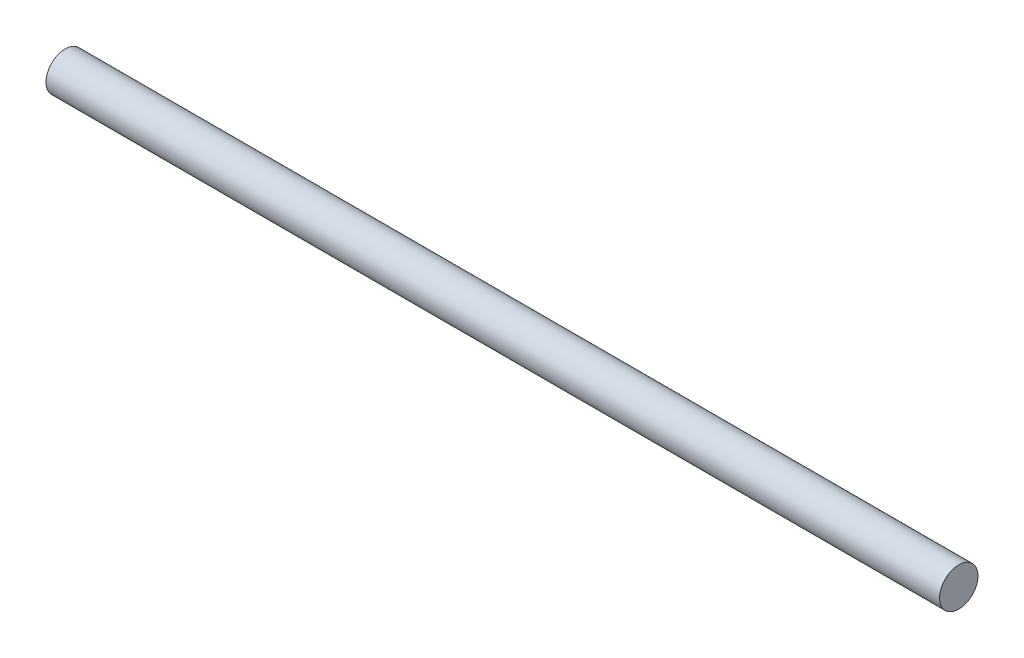
ISO-10303-21;
HEADER;
FILE_DESCRIPTION(('STEP AP214'),'2;1');
FILE_NAME('part.step','',(''),(''),'','','');
FILE_SCHEMA(('AUTOMOTIVE_DESIGN { 1 0 10303 214 1 1 1 1 }'));
ENDSEC;
DATA;
#1=APPLICATION_CONTEXT('core data for automotive mechanical design processes');
#2=APPLICATION_PROTOCOL_DEFINITION('international standard','automotive_design',2000,#1);
#3=PRODUCT_CONTEXT('',#1,'mechanical');
#4=PRODUCT('Part','Part','',(#3));
#5=PRODUCT_RELATED_PRODUCT_CATEGORY('part','',(#4));
#6=PRODUCT_DEFINITION_FORMATION('','',#4);
#7=PRODUCT_DEFINITION_CONTEXT('part definition',#1,'design');
#8=PRODUCT_DEFINITION('design','',#6,#7);
#9=PRODUCT_DEFINITION_SHAPE('','',#8);
#10=(LENGTH_UNIT() NAMED_UNIT(*) SI_UNIT(.MILLI.,.METRE.));
#11=(NAMED_UNIT(*) PLANE_ANGLE_UNIT() SI_UNIT($,.RADIAN.));
#12=(NAMED_UNIT(*) SI_UNIT($,.STERADIAN.) SOLID_ANGLE_UNIT());
#13=UNCERTAINTY_MEASURE_WITH_UNIT(LENGTH_MEASURE(1.E-05),#10,'distance_accuracy_value','');
#14=(GEOMETRIC_REPRESENTATION_CONTEXT(3) GLOBAL_UNCERTAINTY_ASSIGNED_CONTEXT((#13)) GLOBAL_UNIT_ASSIGNED_CONTEXT((#10,
#11,#12)) REPRESENTATION_CONTEXT('',''));
#15=CARTESIAN_POINT('',(0.,0.,0.));
#16=DIRECTION('',(0.,0.,1.));
#17=DIRECTION('',(1.,0.,0.));
#18=AXIS2_PLACEMENT_3D('',#15,#16,#17);
#19=CARTESIAN_POINT('',(295.275,0.,0.));
#20=DIRECTION('',(-1.,0.,0.));
#21=DIRECTION('',(0.,0.,1.));
#22=AXIS2_PLACEMENT_3D('',#19,#20,#21);
#23=CYLINDRICAL_SURFACE('',#22,6.35);
#24=CARTESIAN_POINT('',(295.275,0.,0.));
#25=DIRECTION('',(1.,0.,0.));
#26=DIRECTION('',(0.,0.,-1.));
#27=AXIS2_PLACEMENT_3D('',#24,#25,#26);
#28=CIRCLE('',#27,6.35);
#29=CARTESIAN_POINT('',(295.275,0.,-6.35));
#30=VERTEX_POINT('',#29);
#31=EDGE_CURVE('E10',#30,#30,#28,.T.);
#32=ORIENTED_EDGE('',*,*,#31,.F.);
#33=EDGE_LOOP('',(#32));
#34=FACE_BOUND('',#33,.T.);
#35=CARTESIAN_POINT('',(0.,0.,0.));
#36=DIRECTION('',(1.,0.,0.));
#37=DIRECTION('',(0.,0.,-1.));
#38=AXIS2_PLACEMENT_3D('',#35,#36,#37);
#39=CIRCLE('',#38,6.35);
#40=CARTESIAN_POINT('',(0.,0.,-6.35));
#41=VERTEX_POINT('',#40);
#42=EDGE_CURVE('E34',#41,#41,#39,.T.);
#43=ORIENTED_EDGE('',*,*,#42,.T.);
#44=EDGE_LOOP('',(#43));
#45=FACE_BOUND('',#44,.T.);
#46=ADVANCED_FACE('F31',(#34,#45),#23,.T.);
#47=CARTESIAN_POINT('',(295.275,0.,0.));
#48=DIRECTION('',(1.,0.,0.));
#49=DIRECTION('',(0.,0.,-1.));
#50=AXIS2_PLACEMENT_3D('',#47,#48,#49);
#51=PLANE('',#50);
#52=ORIENTED_EDGE('',*,*,#31,.T.);
#53=EDGE_LOOP('',(#52));
#54=FACE_BOUND('',#53,.T.);
#55=ADVANCED_FACE('F46',(#54),#51,.T.);
#56=CARTESIAN_POINT('',(0.,0.,0.));
#57=DIRECTION('',(1.,0.,0.));
#58=DIRECTION('',(0.,0.,-1.));
#59=AXIS2_PLACEMENT_3D('',#56,#57,#58);
#60=PLANE('',#59);
#61=ORIENTED_EDGE('',*,*,#42,.F.);
#62=EDGE_LOOP('',(#61));
#63=FACE_BOUND('',#62,.T.);
#64=ADVANCED_FACE('F44',(#63),#60,.F.);
#65=CLOSED_SHELL('',(#46,#55,#64));
#66=MANIFOLD_SOLID_BREP('B2',#65);
#67=ADVANCED_BREP_SHAPE_REPRESENTATION('',(#18,#66),#14);
#68=SHAPE_DEFINITION_REPRESENTATION(#9,#67);
ENDSEC;
END-ISO-10303-21;
